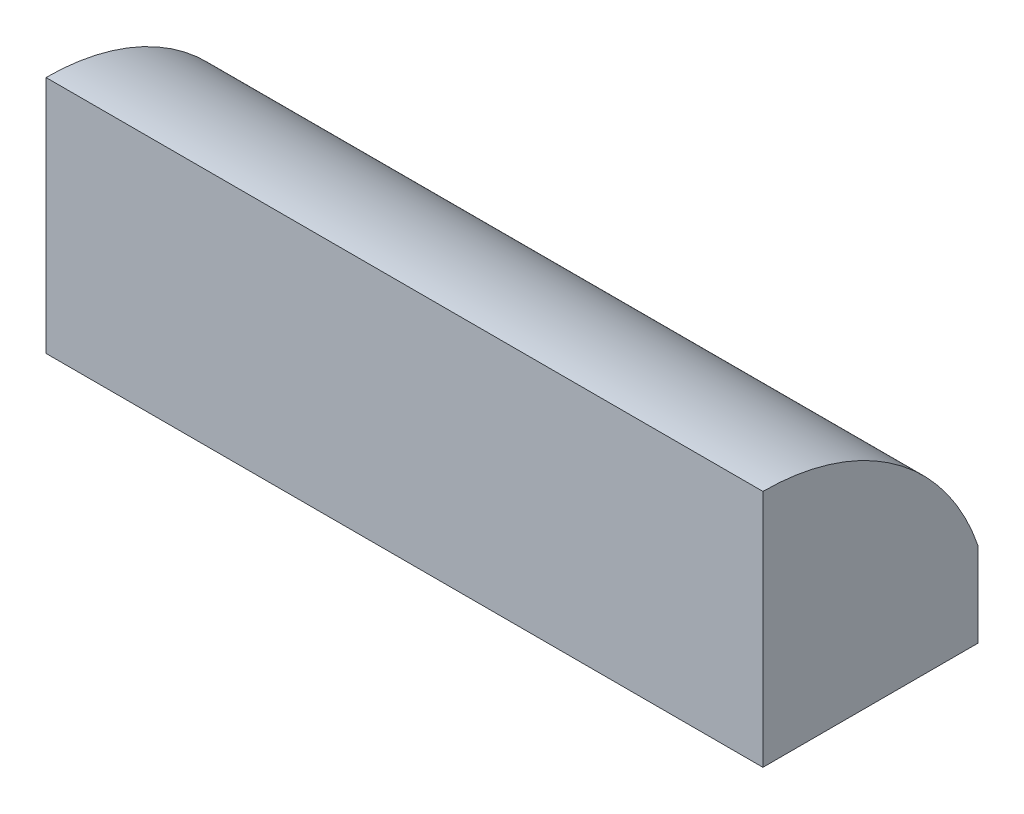
ISO-10303-21;
HEADER;
FILE_DESCRIPTION(('STEP AP214'),'2;1');
FILE_NAME('part.step','',(''),(''),'','','');
FILE_SCHEMA(('AUTOMOTIVE_DESIGN { 1 0 10303 214 1 1 1 1 }'));
ENDSEC;
DATA;
#1=APPLICATION_CONTEXT('core data for automotive mechanical design processes');
#2=APPLICATION_PROTOCOL_DEFINITION('international standard','automotive_design',2000,#1);
#3=PRODUCT_CONTEXT('',#1,'mechanical');
#4=PRODUCT('Part','Part','',(#3));
#5=PRODUCT_RELATED_PRODUCT_CATEGORY('part','',(#4));
#6=PRODUCT_DEFINITION_FORMATION('','',#4);
#7=PRODUCT_DEFINITION_CONTEXT('part definition',#1,'design');
#8=PRODUCT_DEFINITION('design','',#6,#7);
#9=PRODUCT_DEFINITION_SHAPE('','',#8);
#10=(LENGTH_UNIT() NAMED_UNIT(*) SI_UNIT(.MILLI.,.METRE.));
#11=(NAMED_UNIT(*) PLANE_ANGLE_UNIT() SI_UNIT($,.RADIAN.));
#12=(NAMED_UNIT(*) SI_UNIT($,.STERADIAN.) SOLID_ANGLE_UNIT());
#13=UNCERTAINTY_MEASURE_WITH_UNIT(LENGTH_MEASURE(1.E-05),#10,'distance_accuracy_value','');
#14=(GEOMETRIC_REPRESENTATION_CONTEXT(3) GLOBAL_UNCERTAINTY_ASSIGNED_CONTEXT((#13)) GLOBAL_UNIT_ASSIGNED_CONTEXT((#10,
#11,#12)) REPRESENTATION_CONTEXT('',''));
#15=CARTESIAN_POINT('',(0.,0.,0.));
#16=DIRECTION('',(0.,0.,1.));
#17=DIRECTION('',(1.,0.,0.));
#18=AXIS2_PLACEMENT_3D('',#15,#16,#17);
#19=CARTESIAN_POINT('',(-10.7281578947368,25.4,-10.2769736842105));
#20=DIRECTION('',(1.,0.,0.));
#21=DIRECTION('',(0.,0.,-1.));
#22=AXIS2_PLACEMENT_3D('',#19,#20,#21);
#23=PLANE('',#22);
#24=DIRECTION('',(0.,-1.,0.));
#25=VECTOR('',#24,1.);
#26=CARTESIAN_POINT('',(-10.7281578947368,25.4,12.5830263157895));
#27=LINE('',#26,#25);
#28=CARTESIAN_POINT('',(-10.7281578947368,25.4,12.5830263157895));
#29=VERTEX_POINT('',#28);
#30=CARTESIAN_POINT('',(-10.7281578947368,0.,12.5830263157895));
#31=VERTEX_POINT('',#30);
#32=EDGE_CURVE('E11',#29,#31,#27,.T.);
#33=ORIENTED_EDGE('',*,*,#32,.F.);
#34=CARTESIAN_POINT('',(-10.7281578947368,1.28485036364854,12.5830263157895));
#35=DIRECTION('',(-1.,0.,0.));
#36=DIRECTION('',(0.,0.,1.));
#37=AXIS2_PLACEMENT_3D('',#34,#35,#36);
#38=CIRCLE('',#37,24.1151496363515);
#39=CARTESIAN_POINT('',(-10.7281578947368,8.96344671868781,-10.2769736842105));
#40=VERTEX_POINT('',#39);
#41=EDGE_CURVE('E54',#29,#40,#38,.T.);
#42=ORIENTED_EDGE('',*,*,#41,.T.);
#43=DIRECTION('',(0.,-1.,0.));
#44=VECTOR('',#43,1.);
#45=CARTESIAN_POINT('',(-10.7281578947368,25.4,-10.2769736842105));
#46=LINE('',#45,#44);
#47=CARTESIAN_POINT('',(-10.7281578947368,0.,-10.2769736842105));
#48=VERTEX_POINT('',#47);
#49=EDGE_CURVE('E84',#40,#48,#46,.T.);
#50=ORIENTED_EDGE('',*,*,#49,.T.);
#51=DIRECTION('',(0.,0.,1.));
#52=VECTOR('',#51,1.);
#53=CARTESIAN_POINT('',(-10.7281578947368,0.,-10.2769736842105));
#54=LINE('',#53,#52);
#55=EDGE_CURVE('E96',#48,#31,#54,.T.);
#56=ORIENTED_EDGE('',*,*,#55,.T.);
#57=EDGE_LOOP('',(#33,#42,#50,#56));
#58=FACE_BOUND('',#57,.T.);
#59=ADVANCED_FACE('F39',(#58),#23,.F.);
#60=CARTESIAN_POINT('',(-10.7281578947368,25.4,12.5830263157895));
#61=DIRECTION('',(0.,0.,-1.));
#62=DIRECTION('',(-1.,0.,0.));
#63=AXIS2_PLACEMENT_3D('',#60,#61,#62);
#64=PLANE('',#63);
#65=DIRECTION('',(1.,0.,0.));
#66=VECTOR('',#65,1.);
#67=CARTESIAN_POINT('',(-10.7281578947368,0.,12.5830263157895));
#68=LINE('',#67,#66);
#69=CARTESIAN_POINT('',(65.4718421052632,0.,12.5830263157895));
#70=VERTEX_POINT('',#69);
#71=EDGE_CURVE('E92',#31,#70,#68,.T.);
#72=ORIENTED_EDGE('',*,*,#71,.T.);
#73=DIRECTION('',(0.,-1.,0.));
#74=VECTOR('',#73,1.);
#75=CARTESIAN_POINT('',(65.4718421052632,25.4,12.5830263157895));
#76=LINE('',#75,#74);
#77=CARTESIAN_POINT('',(65.4718421052632,25.4,12.5830263157895));
#78=VERTEX_POINT('',#77);
#79=EDGE_CURVE('E47',#78,#70,#76,.T.);
#80=ORIENTED_EDGE('',*,*,#79,.F.);
#81=DIRECTION('',(1.,0.,0.));
#82=VECTOR('',#81,1.);
#83=CARTESIAN_POINT('',(-10.7281578947368,25.4,12.5830263157895));
#84=LINE('',#83,#82);
#85=EDGE_CURVE('E97',#29,#78,#84,.T.);
#86=ORIENTED_EDGE('',*,*,#85,.F.);
#87=ORIENTED_EDGE('',*,*,#32,.T.);
#88=EDGE_LOOP('',(#72,#80,#86,#87));
#89=FACE_BOUND('',#88,.T.);
#90=ADVANCED_FACE('F113',(#89),#64,.F.);
#91=CARTESIAN_POINT('',(65.4718421052632,25.4,-10.2769736842105));
#92=DIRECTION('',(-1.,0.,0.));
#93=DIRECTION('',(0.,0.,1.));
#94=AXIS2_PLACEMENT_3D('',#91,#92,#93);
#95=PLANE('',#94);
#96=DIRECTION('',(0.,-1.,0.));
#97=VECTOR('',#96,1.);
#98=CARTESIAN_POINT('',(65.4718421052632,25.4,-10.2769736842105));
#99=LINE('',#98,#97);
#100=CARTESIAN_POINT('',(65.4718421052632,8.96344671868781,-10.2769736842105));
#101=VERTEX_POINT('',#100);
#102=CARTESIAN_POINT('',(65.4718421052632,0.,-10.2769736842105));
#103=VERTEX_POINT('',#102);
#104=EDGE_CURVE('E73',#101,#103,#99,.T.);
#105=ORIENTED_EDGE('',*,*,#104,.F.);
#106=CARTESIAN_POINT('',(65.4718421052632,1.28485036364854,12.5830263157895));
#107=DIRECTION('',(-1.,0.,0.));
#108=DIRECTION('',(0.,0.,1.));
#109=AXIS2_PLACEMENT_3D('',#106,#107,#108);
#110=CIRCLE('',#109,24.1151496363515);
#111=EDGE_CURVE('E106',#78,#101,#110,.T.);
#112=ORIENTED_EDGE('',*,*,#111,.F.);
#113=ORIENTED_EDGE('',*,*,#79,.T.);
#114=DIRECTION('',(0.,0.,-1.));
#115=VECTOR('',#114,1.);
#116=CARTESIAN_POINT('',(65.4718421052632,0.,-10.2769736842105));
#117=LINE('',#116,#115);
#118=EDGE_CURVE('E88',#70,#103,#117,.T.);
#119=ORIENTED_EDGE('',*,*,#118,.T.);
#120=EDGE_LOOP('',(#105,#112,#113,#119));
#121=FACE_BOUND('',#120,.T.);
#122=ADVANCED_FACE('F89',(#121),#95,.F.);
#123=CARTESIAN_POINT('',(-10.7281578947368,25.4,-10.2769736842105));
#124=DIRECTION('',(0.,0.,1.));
#125=DIRECTION('',(1.,0.,0.));
#126=AXIS2_PLACEMENT_3D('',#123,#124,#125);
#127=PLANE('',#126);
#128=ORIENTED_EDGE('',*,*,#49,.F.);
#129=DIRECTION('',(1.,0.,0.));
#130=VECTOR('',#129,1.);
#131=CARTESIAN_POINT('',(-10.7281578947368,8.96344671868781,-10.2769736842105));
#132=LINE('',#131,#130);
#133=EDGE_CURVE('E81',#40,#101,#132,.T.);
#134=ORIENTED_EDGE('',*,*,#133,.T.);
#135=ORIENTED_EDGE('',*,*,#104,.T.);
#136=DIRECTION('',(-1.,0.,0.));
#137=VECTOR('',#136,1.);
#138=CARTESIAN_POINT('',(-10.7281578947368,0.,-10.2769736842105));
#139=LINE('',#138,#137);
#140=EDGE_CURVE('E78',#103,#48,#139,.T.);
#141=ORIENTED_EDGE('',*,*,#140,.T.);
#142=EDGE_LOOP('',(#128,#134,#135,#141));
#143=FACE_BOUND('',#142,.T.);
#144=ADVANCED_FACE('F76',(#143),#127,.F.);
#145=CARTESIAN_POINT('',(0.,0.,0.));
#146=DIRECTION('',(0.,1.,0.));
#147=DIRECTION('',(0.,0.,1.));
#148=AXIS2_PLACEMENT_3D('',#145,#146,#147);
#149=PLANE('',#148);
#150=ORIENTED_EDGE('',*,*,#55,.F.);
#151=ORIENTED_EDGE('',*,*,#140,.F.);
#152=ORIENTED_EDGE('',*,*,#118,.F.);
#153=ORIENTED_EDGE('',*,*,#71,.F.);
#154=EDGE_LOOP('',(#150,#151,#152,#153));
#155=FACE_BOUND('',#154,.T.);
#156=ADVANCED_FACE('F94',(#155),#149,.F.);
#157=CARTESIAN_POINT('',(-10.7281578947368,1.28485036364854,12.5830263157895));
#158=DIRECTION('',(1.,0.,0.));
#159=DIRECTION('',(0.,0.,-1.));
#160=AXIS2_PLACEMENT_3D('',#157,#158,#159);
#161=CYLINDRICAL_SURFACE('',#160,24.1151496363515);
#162=ORIENTED_EDGE('',*,*,#111,.T.);
#163=ORIENTED_EDGE('',*,*,#133,.F.);
#164=ORIENTED_EDGE('',*,*,#41,.F.);
#165=ORIENTED_EDGE('',*,*,#85,.T.);
#166=EDGE_LOOP('',(#162,#163,#164,#165));
#167=FACE_BOUND('',#166,.T.);
#168=ADVANCED_FACE('F107',(#167),#161,.T.);
#169=CLOSED_SHELL('',(#59,#90,#122,#144,#156,#168));
#170=MANIFOLD_SOLID_BREP('B2',#169);
#171=ADVANCED_BREP_SHAPE_REPRESENTATION('',(#18,#170),#14);
#172=SHAPE_DEFINITION_REPRESENTATION(#9,#171);
ENDSEC;
END-ISO-10303-21;
